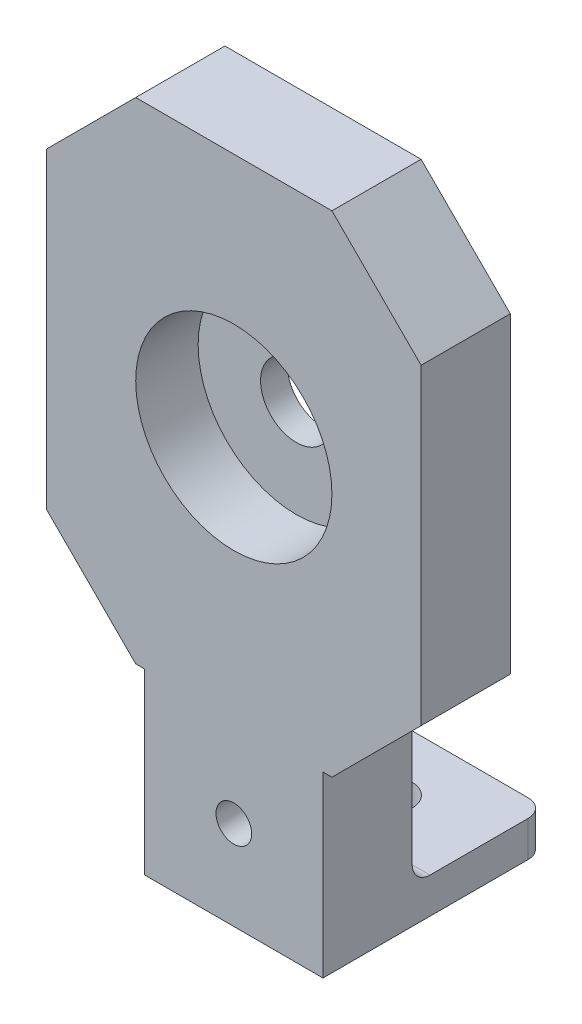
ISO-10303-21;
HEADER;
FILE_DESCRIPTION(('STEP AP214'),'2;1');
FILE_NAME('part.step','',(''),(''),'','','');
FILE_SCHEMA(('AUTOMOTIVE_DESIGN { 1 0 10303 214 1 1 1 1 }'));
ENDSEC;
DATA;
#1=APPLICATION_CONTEXT('core data for automotive mechanical design processes');
#2=APPLICATION_PROTOCOL_DEFINITION('international standard','automotive_design',2000,#1);
#3=PRODUCT_CONTEXT('',#1,'mechanical');
#4=PRODUCT('Part','Part','',(#3));
#5=PRODUCT_RELATED_PRODUCT_CATEGORY('part','',(#4));
#6=PRODUCT_DEFINITION_FORMATION('','',#4);
#7=PRODUCT_DEFINITION_CONTEXT('part definition',#1,'design');
#8=PRODUCT_DEFINITION('design','',#6,#7);
#9=PRODUCT_DEFINITION_SHAPE('','',#8);
#10=(LENGTH_UNIT() NAMED_UNIT(*) SI_UNIT(.MILLI.,.METRE.));
#11=(NAMED_UNIT(*) PLANE_ANGLE_UNIT() SI_UNIT($,.RADIAN.));
#12=(NAMED_UNIT(*) SI_UNIT($,.STERADIAN.) SOLID_ANGLE_UNIT());
#13=UNCERTAINTY_MEASURE_WITH_UNIT(LENGTH_MEASURE(1.E-05),#10,'distance_accuracy_value','');
#14=(GEOMETRIC_REPRESENTATION_CONTEXT(3) GLOBAL_UNCERTAINTY_ASSIGNED_CONTEXT((#13)) GLOBAL_UNIT_ASSIGNED_CONTEXT((#10,
#11,#12)) REPRESENTATION_CONTEXT('',''));
#15=CARTESIAN_POINT('',(0.,0.,0.));
#16=DIRECTION('',(0.,0.,1.));
#17=DIRECTION('',(1.,0.,0.));
#18=AXIS2_PLACEMENT_3D('',#15,#16,#17);
#19=CARTESIAN_POINT('',(21.,-27.5,10.));
#20=DIRECTION('',(-1.,0.,0.));
#21=DIRECTION('',(0.,-1.,0.));
#22=AXIS2_PLACEMENT_3D('',#19,#20,#21);
#23=PLANE('',#22);
#24=DIRECTION('',(0.,1.,0.));
#25=VECTOR('',#24,1.);
#26=CARTESIAN_POINT('',(21.,-27.5,10.));
#27=LINE('',#26,#25);
#28=CARTESIAN_POINT('',(21.,-17.5,10.));
#29=VERTEX_POINT('',#28);
#30=CARTESIAN_POINT('',(21.,17.5,10.));
#31=VERTEX_POINT('',#30);
#32=EDGE_CURVE('E211',#29,#31,#27,.T.);
#33=ORIENTED_EDGE('',*,*,#32,.F.);
#34=DIRECTION('',(0.,0.,-1.));
#35=VECTOR('',#34,1.);
#36=CARTESIAN_POINT('',(21.,-17.5,10.));
#37=LINE('',#36,#35);
#38=CARTESIAN_POINT('',(21.,-17.5,0.));
#39=VERTEX_POINT('',#38);
#40=EDGE_CURVE('E240',#29,#39,#37,.T.);
#41=ORIENTED_EDGE('',*,*,#40,.T.);
#42=DIRECTION('',(0.,1.,0.));
#43=VECTOR('',#42,1.);
#44=CARTESIAN_POINT('',(21.,-27.5,0.));
#45=LINE('',#44,#43);
#46=CARTESIAN_POINT('',(21.,17.5,0.));
#47=VERTEX_POINT('',#46);
#48=EDGE_CURVE('E193',#39,#47,#45,.T.);
#49=ORIENTED_EDGE('',*,*,#48,.T.);
#50=DIRECTION('',(0.,0.,1.));
#51=VECTOR('',#50,1.);
#52=CARTESIAN_POINT('',(21.,17.5,10.));
#53=LINE('',#52,#51);
#54=EDGE_CURVE('E238',#47,#31,#53,.T.);
#55=ORIENTED_EDGE('',*,*,#54,.T.);
#56=EDGE_LOOP('',(#33,#41,#49,#55));
#57=FACE_BOUND('',#56,.T.);
#58=ADVANCED_FACE('F37',(#57),#23,.F.);
#59=CARTESIAN_POINT('',(-21.,27.5,10.));
#60=DIRECTION('',(0.,-1.,0.));
#61=DIRECTION('',(1.,0.,0.));
#62=AXIS2_PLACEMENT_3D('',#59,#60,#61);
#63=PLANE('',#62);
#64=DIRECTION('',(-1.,0.,0.));
#65=VECTOR('',#64,1.);
#66=CARTESIAN_POINT('',(-21.,27.5,10.));
#67=LINE('',#66,#65);
#68=CARTESIAN_POINT('',(11.,27.5,10.));
#69=VERTEX_POINT('',#68);
#70=CARTESIAN_POINT('',(-11.,27.5,10.));
#71=VERTEX_POINT('',#70);
#72=EDGE_CURVE('E309',#69,#71,#67,.T.);
#73=ORIENTED_EDGE('',*,*,#72,.F.);
#74=DIRECTION('',(0.,0.,-1.));
#75=VECTOR('',#74,1.);
#76=CARTESIAN_POINT('',(11.,27.5,10.));
#77=LINE('',#76,#75);
#78=CARTESIAN_POINT('',(11.,27.5,0.));
#79=VERTEX_POINT('',#78);
#80=EDGE_CURVE('E247',#69,#79,#77,.T.);
#81=ORIENTED_EDGE('',*,*,#80,.T.);
#82=DIRECTION('',(-1.,0.,0.));
#83=VECTOR('',#82,1.);
#84=CARTESIAN_POINT('',(-21.,27.5,0.));
#85=LINE('',#84,#83);
#86=CARTESIAN_POINT('',(-11.,27.5,0.));
#87=VERTEX_POINT('',#86);
#88=EDGE_CURVE('E196',#79,#87,#85,.T.);
#89=ORIENTED_EDGE('',*,*,#88,.T.);
#90=DIRECTION('',(0.,0.,1.));
#91=VECTOR('',#90,1.);
#92=CARTESIAN_POINT('',(-11.,27.5,10.));
#93=LINE('',#92,#91);
#94=EDGE_CURVE('E245',#87,#71,#93,.T.);
#95=ORIENTED_EDGE('',*,*,#94,.T.);
#96=EDGE_LOOP('',(#73,#81,#89,#95));
#97=FACE_BOUND('',#96,.T.);
#98=ADVANCED_FACE('F326',(#97),#63,.F.);
#99=CARTESIAN_POINT('',(-21.,-27.5,10.));
#100=DIRECTION('',(1.,0.,0.));
#101=DIRECTION('',(0.,0.,-1.));
#102=AXIS2_PLACEMENT_3D('',#99,#100,#101);
#103=PLANE('',#102);
#104=DIRECTION('',(0.,-1.,0.));
#105=VECTOR('',#104,1.);
#106=CARTESIAN_POINT('',(-21.,-27.5,0.));
#107=LINE('',#106,#105);
#108=CARTESIAN_POINT('',(-21.,17.5,0.));
#109=VERTEX_POINT('',#108);
#110=CARTESIAN_POINT('',(-21.,-17.5,0.));
#111=VERTEX_POINT('',#110);
#112=EDGE_CURVE('E200',#109,#111,#107,.T.);
#113=ORIENTED_EDGE('',*,*,#112,.T.);
#114=DIRECTION('',(0.,0.,1.));
#115=VECTOR('',#114,1.);
#116=CARTESIAN_POINT('',(-21.,-17.5,10.));
#117=LINE('',#116,#115);
#118=CARTESIAN_POINT('',(-21.,-17.5,10.));
#119=VERTEX_POINT('',#118);
#120=EDGE_CURVE('E229',#111,#119,#117,.T.);
#121=ORIENTED_EDGE('',*,*,#120,.T.);
#122=DIRECTION('',(0.,-1.,0.));
#123=VECTOR('',#122,1.);
#124=CARTESIAN_POINT('',(-21.,-27.5,10.));
#125=LINE('',#124,#123);
#126=CARTESIAN_POINT('',(-21.,17.5,10.));
#127=VERTEX_POINT('',#126);
#128=EDGE_CURVE('E168',#127,#119,#125,.T.);
#129=ORIENTED_EDGE('',*,*,#128,.F.);
#130=DIRECTION('',(0.,0.,-1.));
#131=VECTOR('',#130,1.);
#132=CARTESIAN_POINT('',(-21.,17.5,10.));
#133=LINE('',#132,#131);
#134=EDGE_CURVE('E226',#127,#109,#133,.T.);
#135=ORIENTED_EDGE('',*,*,#134,.T.);
#136=EDGE_LOOP('',(#113,#121,#129,#135));
#137=FACE_BOUND('',#136,.T.);
#138=ADVANCED_FACE('F319',(#137),#103,.F.);
#139=CARTESIAN_POINT('',(-9.99999999999999,-27.5,10.));
#140=DIRECTION('',(0.,1.,0.));
#141=DIRECTION('',(0.,0.,1.));
#142=AXIS2_PLACEMENT_3D('',#139,#140,#141);
#143=PLANE('',#142);
#144=DIRECTION('',(1.,0.,0.));
#145=VECTOR('',#144,1.);
#146=CARTESIAN_POINT('',(-9.99999999999999,-27.5,10.));
#147=LINE('',#146,#145);
#148=CARTESIAN_POINT('',(-11.,-27.5,10.));
#149=VERTEX_POINT('',#148);
#150=CARTESIAN_POINT('',(-9.99999999999999,-27.5,10.));
#151=VERTEX_POINT('',#150);
#152=EDGE_CURVE('E157',#149,#151,#147,.T.);
#153=ORIENTED_EDGE('',*,*,#152,.F.);
#154=DIRECTION('',(0.,0.,-1.));
#155=VECTOR('',#154,1.);
#156=CARTESIAN_POINT('',(-11.,-27.5,10.));
#157=LINE('',#156,#155);
#158=CARTESIAN_POINT('',(-11.,-27.5,0.));
#159=VERTEX_POINT('',#158);
#160=EDGE_CURVE('E177',#149,#159,#157,.T.);
#161=ORIENTED_EDGE('',*,*,#160,.T.);
#162=DIRECTION('',(1.,0.,0.));
#163=VECTOR('',#162,1.);
#164=CARTESIAN_POINT('',(-9.99999999999999,-27.5,0.));
#165=LINE('',#164,#163);
#166=CARTESIAN_POINT('',(-9.99999999999999,-27.5,0.));
#167=VERTEX_POINT('',#166);
#168=EDGE_CURVE('E174',#159,#167,#165,.T.);
#169=ORIENTED_EDGE('',*,*,#168,.T.);
#170=DIRECTION('',(0.,0.,-1.));
#171=VECTOR('',#170,1.);
#172=CARTESIAN_POINT('',(-9.99999999999999,-27.5,10.));
#173=LINE('',#172,#171);
#174=EDGE_CURVE('E171',#151,#167,#173,.T.);
#175=ORIENTED_EDGE('',*,*,#174,.F.);
#176=EDGE_LOOP('',(#153,#161,#169,#175));
#177=FACE_BOUND('',#176,.T.);
#178=ADVANCED_FACE('F172',(#177),#143,.F.);
#179=CARTESIAN_POINT('',(-10.,-47.5,10.));
#180=DIRECTION('',(1.,0.,0.));
#181=DIRECTION('',(0.,1.,0.));
#182=AXIS2_PLACEMENT_3D('',#179,#180,#181);
#183=PLANE('',#182);
#184=DIRECTION('',(0.,0.,1.));
#185=VECTOR('',#184,1.);
#186=CARTESIAN_POINT('',(-9.99999999999999,-43.5,-15.));
#187=LINE('',#186,#185);
#188=CARTESIAN_POINT('',(-9.99999999999999,-43.5,-13.));
#189=VERTEX_POINT('',#188);
#190=CARTESIAN_POINT('',(-9.99999999999999,-43.5,-2.));
#191=VERTEX_POINT('',#190);
#192=EDGE_CURVE('E287',#189,#191,#187,.T.);
#193=ORIENTED_EDGE('',*,*,#192,.F.);
#194=DIRECTION('',(0.,1.,0.));
#195=VECTOR('',#194,1.);
#196=CARTESIAN_POINT('',(-10.,-47.5,-13.));
#197=LINE('',#196,#195);
#198=CARTESIAN_POINT('',(-10.,-47.5,-13.));
#199=VERTEX_POINT('',#198);
#200=EDGE_CURVE('E60',#189,#199,#197,.F.);
#201=ORIENTED_EDGE('',*,*,#200,.T.);
#202=DIRECTION('',(0.,0.,-1.));
#203=VECTOR('',#202,1.);
#204=CARTESIAN_POINT('',(-10.,-47.5,10.));
#205=LINE('',#204,#203);
#206=CARTESIAN_POINT('',(-10.,-47.5,10.));
#207=VERTEX_POINT('',#206);
#208=EDGE_CURVE('E178',#207,#199,#205,.T.);
#209=ORIENTED_EDGE('',*,*,#208,.F.);
#210=DIRECTION('',(0.,-1.,0.));
#211=VECTOR('',#210,1.);
#212=CARTESIAN_POINT('',(-10.,-47.5,10.));
#213=LINE('',#212,#211);
#214=EDGE_CURVE('E162',#151,#207,#213,.T.);
#215=ORIENTED_EDGE('',*,*,#214,.F.);
#216=ORIENTED_EDGE('',*,*,#174,.T.);
#217=DIRECTION('',(0.,-1.,0.));
#218=VECTOR('',#217,1.);
#219=CARTESIAN_POINT('',(-10.,-47.5,0.));
#220=LINE('',#219,#218);
#221=CARTESIAN_POINT('',(-10.,-41.5,0.));
#222=VERTEX_POINT('',#221);
#223=EDGE_CURVE('E204',#167,#222,#220,.T.);
#224=ORIENTED_EDGE('',*,*,#223,.T.);
#225=CARTESIAN_POINT('',(-10.,-41.5,-2.));
#226=DIRECTION('',(1.,0.,0.));
#227=DIRECTION('',(0.,1.,0.));
#228=AXIS2_PLACEMENT_3D('',#225,#226,#227);
#229=CIRCLE('',#228,2.);
#230=EDGE_CURVE('E11',#222,#191,#229,.T.);
#231=ORIENTED_EDGE('',*,*,#230,.T.);
#232=EDGE_LOOP('',(#193,#201,#209,#215,#216,#224,#231));
#233=FACE_BOUND('',#232,.T.);
#234=ADVANCED_FACE('F180',(#233),#183,.F.);
#235=CARTESIAN_POINT('',(-10.,-47.5,10.));
#236=DIRECTION('',(0.,1.,0.));
#237=DIRECTION('',(0.,0.,1.));
#238=AXIS2_PLACEMENT_3D('',#235,#236,#237);
#239=PLANE('',#238);
#240=CARTESIAN_POINT('',(0.,-47.5,-7.5));
#241=DIRECTION('',(0.,1.,0.));
#242=DIRECTION('',(0.,0.,1.));
#243=AXIS2_PLACEMENT_3D('',#240,#241,#242);
#244=CIRCLE('',#243,2.5);
#245=CARTESIAN_POINT('',(0.,-47.5,-5.));
#246=VERTEX_POINT('',#245);
#247=EDGE_CURVE('E403',#246,#246,#244,.T.);
#248=ORIENTED_EDGE('',*,*,#247,.T.);
#249=EDGE_LOOP('',(#248));
#250=FACE_BOUND('',#249,.T.);
#251=ORIENTED_EDGE('',*,*,#208,.T.);
#252=CARTESIAN_POINT('',(-8.,-47.5,-13.));
#253=DIRECTION('',(0.,1.,0.));
#254=DIRECTION('',(0.,0.,1.));
#255=AXIS2_PLACEMENT_3D('',#252,#253,#254);
#256=CIRCLE('',#255,2.);
#257=CARTESIAN_POINT('',(-7.99999999999999,-47.5,-15.));
#258=VERTEX_POINT('',#257);
#259=EDGE_CURVE('E267',#199,#258,#256,.F.);
#260=ORIENTED_EDGE('',*,*,#259,.T.);
#261=DIRECTION('',(-1.,0.,0.));
#262=VECTOR('',#261,1.);
#263=CARTESIAN_POINT('',(10.,-47.5,-15.));
#264=LINE('',#263,#262);
#265=CARTESIAN_POINT('',(8.00000000000001,-47.5,-15.));
#266=VERTEX_POINT('',#265);
#267=EDGE_CURVE('E398',#266,#258,#264,.T.);
#268=ORIENTED_EDGE('',*,*,#267,.F.);
#269=CARTESIAN_POINT('',(8.00000000000001,-47.5,-13.));
#270=DIRECTION('',(0.,1.,0.));
#271=DIRECTION('',(0.,0.,1.));
#272=AXIS2_PLACEMENT_3D('',#269,#270,#271);
#273=CIRCLE('',#272,2.);
#274=CARTESIAN_POINT('',(10.,-47.5,-13.));
#275=VERTEX_POINT('',#274);
#276=EDGE_CURVE('E52',#266,#275,#273,.F.);
#277=ORIENTED_EDGE('',*,*,#276,.T.);
#278=DIRECTION('',(0.,0.,-1.));
#279=VECTOR('',#278,1.);
#280=CARTESIAN_POINT('',(10.,-47.5,10.));
#281=LINE('',#280,#279);
#282=CARTESIAN_POINT('',(10.,-47.5,10.));
#283=VERTEX_POINT('',#282);
#284=EDGE_CURVE('E214',#283,#275,#281,.T.);
#285=ORIENTED_EDGE('',*,*,#284,.F.);
#286=DIRECTION('',(1.,0.,0.));
#287=VECTOR('',#286,1.);
#288=CARTESIAN_POINT('',(-10.,-47.5,10.));
#289=LINE('',#288,#287);
#290=EDGE_CURVE('E182',#207,#283,#289,.T.);
#291=ORIENTED_EDGE('',*,*,#290,.F.);
#292=EDGE_LOOP('',(#251,#260,#268,#277,#285,#291));
#293=FACE_BOUND('',#292,.T.);
#294=ADVANCED_FACE('F345',(#250,#293),#239,.F.);
#295=CARTESIAN_POINT('',(10.,-47.5,10.));
#296=DIRECTION('',(-1.,0.,0.));
#297=DIRECTION('',(0.,-1.,0.));
#298=AXIS2_PLACEMENT_3D('',#295,#296,#297);
#299=PLANE('',#298);
#300=ORIENTED_EDGE('',*,*,#284,.T.);
#301=DIRECTION('',(0.,-1.,0.));
#302=VECTOR('',#301,1.);
#303=CARTESIAN_POINT('',(10.,-47.5,-13.));
#304=LINE('',#303,#302);
#305=CARTESIAN_POINT('',(10.,-43.5,-13.));
#306=VERTEX_POINT('',#305);
#307=EDGE_CURVE('E269',#275,#306,#304,.F.);
#308=ORIENTED_EDGE('',*,*,#307,.T.);
#309=DIRECTION('',(0.,0.,1.));
#310=VECTOR('',#309,1.);
#311=CARTESIAN_POINT('',(10.,-43.5,-15.));
#312=LINE('',#311,#310);
#313=CARTESIAN_POINT('',(10.,-43.5,-2.));
#314=VERTEX_POINT('',#313);
#315=EDGE_CURVE('E276',#306,#314,#312,.T.);
#316=ORIENTED_EDGE('',*,*,#315,.T.);
#317=CARTESIAN_POINT('',(10.,-41.5,-2.));
#318=DIRECTION('',(-1.,0.,0.));
#319=DIRECTION('',(0.,-1.,0.));
#320=AXIS2_PLACEMENT_3D('',#317,#318,#319);
#321=CIRCLE('',#320,2.);
#322=CARTESIAN_POINT('',(10.,-41.5,0.));
#323=VERTEX_POINT('',#322);
#324=EDGE_CURVE('E45',#314,#323,#321,.T.);
#325=ORIENTED_EDGE('',*,*,#324,.T.);
#326=DIRECTION('',(0.,1.,0.));
#327=VECTOR('',#326,1.);
#328=CARTESIAN_POINT('',(10.,-47.5,0.));
#329=LINE('',#328,#327);
#330=CARTESIAN_POINT('',(10.,-27.5,0.));
#331=VERTEX_POINT('',#330);
#332=EDGE_CURVE('E206',#323,#331,#329,.T.);
#333=ORIENTED_EDGE('',*,*,#332,.T.);
#334=DIRECTION('',(0.,0.,-1.));
#335=VECTOR('',#334,1.);
#336=CARTESIAN_POINT('',(10.,-27.5,10.));
#337=LINE('',#336,#335);
#338=CARTESIAN_POINT('',(10.,-27.5,10.));
#339=VERTEX_POINT('',#338);
#340=EDGE_CURVE('E192',#339,#331,#337,.T.);
#341=ORIENTED_EDGE('',*,*,#340,.F.);
#342=DIRECTION('',(0.,1.,0.));
#343=VECTOR('',#342,1.);
#344=CARTESIAN_POINT('',(10.,-47.5,10.));
#345=LINE('',#344,#343);
#346=EDGE_CURVE('E184',#283,#339,#345,.T.);
#347=ORIENTED_EDGE('',*,*,#346,.F.);
#348=EDGE_LOOP('',(#300,#308,#316,#325,#333,#341,#347));
#349=FACE_BOUND('',#348,.T.);
#350=ADVANCED_FACE('F273',(#349),#299,.F.);
#351=CARTESIAN_POINT('',(10.,-27.5,10.));
#352=DIRECTION('',(0.,1.,0.));
#353=DIRECTION('',(0.,0.,1.));
#354=AXIS2_PLACEMENT_3D('',#351,#352,#353);
#355=PLANE('',#354);
#356=DIRECTION('',(1.,0.,0.));
#357=VECTOR('',#356,1.);
#358=CARTESIAN_POINT('',(10.,-27.5,0.));
#359=LINE('',#358,#357);
#360=CARTESIAN_POINT('',(11.,-27.5,0.));
#361=VERTEX_POINT('',#360);
#362=EDGE_CURVE('E208',#331,#361,#359,.T.);
#363=ORIENTED_EDGE('',*,*,#362,.T.);
#364=DIRECTION('',(0.,0.,1.));
#365=VECTOR('',#364,1.);
#366=CARTESIAN_POINT('',(11.,-27.5,10.));
#367=LINE('',#366,#365);
#368=CARTESIAN_POINT('',(11.,-27.5,10.));
#369=VERTEX_POINT('',#368);
#370=EDGE_CURVE('E243',#361,#369,#367,.T.);
#371=ORIENTED_EDGE('',*,*,#370,.T.);
#372=DIRECTION('',(1.,0.,0.));
#373=VECTOR('',#372,1.);
#374=CARTESIAN_POINT('',(10.,-27.5,10.));
#375=LINE('',#374,#373);
#376=EDGE_CURVE('E189',#339,#369,#375,.T.);
#377=ORIENTED_EDGE('',*,*,#376,.F.);
#378=ORIENTED_EDGE('',*,*,#340,.T.);
#379=EDGE_LOOP('',(#363,#371,#377,#378));
#380=FACE_BOUND('',#379,.T.);
#381=ADVANCED_FACE('F341',(#380),#355,.F.);
#382=CARTESIAN_POINT('',(0.,0.,10.));
#383=DIRECTION('',(0.,0.,-1.));
#384=DIRECTION('',(-1.,0.,0.));
#385=AXIS2_PLACEMENT_3D('',#382,#383,#384);
#386=PLANE('',#385);
#387=CARTESIAN_POINT('',(0.,-37.5,10.));
#388=DIRECTION('',(0.,0.,-1.));
#389=DIRECTION('',(-1.,0.,0.));
#390=AXIS2_PLACEMENT_3D('',#387,#388,#389);
#391=CIRCLE('',#390,2.);
#392=CARTESIAN_POINT('',(-2.,-37.5,10.));
#393=VERTEX_POINT('',#392);
#394=EDGE_CURVE('E410',#393,#393,#391,.T.);
#395=ORIENTED_EDGE('',*,*,#394,.T.);
#396=EDGE_LOOP('',(#395));
#397=FACE_BOUND('',#396,.T.);
#398=CARTESIAN_POINT('',(0.,0.,10.));
#399=DIRECTION('',(0.,0.,1.));
#400=DIRECTION('',(1.,0.,0.));
#401=AXIS2_PLACEMENT_3D('',#398,#399,#400);
#402=CIRCLE('',#401,11.);
#403=CARTESIAN_POINT('',(11.,0.,10.));
#404=VERTEX_POINT('',#403);
#405=EDGE_CURVE('E301',#404,#404,#402,.T.);
#406=ORIENTED_EDGE('',*,*,#405,.F.);
#407=EDGE_LOOP('',(#406));
#408=FACE_BOUND('',#407,.T.);
#409=ORIENTED_EDGE('',*,*,#128,.T.);
#410=DIRECTION('',(-0.707106781186546,0.707106781186549,0.));
#411=VECTOR('',#410,1.);
#412=CARTESIAN_POINT('',(-11.,-27.5,10.));
#413=LINE('',#412,#411);
#414=EDGE_CURVE('E164',#119,#149,#413,.F.);
#415=ORIENTED_EDGE('',*,*,#414,.T.);
#416=ORIENTED_EDGE('',*,*,#152,.T.);
#417=ORIENTED_EDGE('',*,*,#214,.T.);
#418=ORIENTED_EDGE('',*,*,#290,.T.);
#419=ORIENTED_EDGE('',*,*,#346,.T.);
#420=ORIENTED_EDGE('',*,*,#376,.T.);
#421=DIRECTION('',(-0.707106781186548,-0.707106781186547,0.));
#422=VECTOR('',#421,1.);
#423=CARTESIAN_POINT('',(21.,-17.5,10.));
#424=LINE('',#423,#422);
#425=EDGE_CURVE('E235',#369,#29,#424,.F.);
#426=ORIENTED_EDGE('',*,*,#425,.T.);
#427=ORIENTED_EDGE('',*,*,#32,.T.);
#428=DIRECTION('',(0.707106781186547,-0.707106781186548,0.));
#429=VECTOR('',#428,1.);
#430=CARTESIAN_POINT('',(11.,27.5,10.));
#431=LINE('',#430,#429);
#432=EDGE_CURVE('E233',#31,#69,#431,.F.);
#433=ORIENTED_EDGE('',*,*,#432,.T.);
#434=ORIENTED_EDGE('',*,*,#72,.T.);
#435=DIRECTION('',(0.707106781186549,0.707106781186546,0.));
#436=VECTOR('',#435,1.);
#437=CARTESIAN_POINT('',(-21.,17.5,10.));
#438=LINE('',#437,#436);
#439=EDGE_CURVE('E231',#71,#127,#438,.F.);
#440=ORIENTED_EDGE('',*,*,#439,.T.);
#441=EDGE_LOOP('',(#409,#415,#416,#417,#418,#419,#420,#426,#427,#433,#434,#440));
#442=FACE_BOUND('',#441,.T.);
#443=ADVANCED_FACE('F160',(#397,#408,#442),#386,.F.);
#444=CARTESIAN_POINT('',(0.,0.,0.));
#445=DIRECTION('',(0.,0.,-1.));
#446=DIRECTION('',(-1.,0.,0.));
#447=AXIS2_PLACEMENT_3D('',#444,#445,#446);
#448=PLANE('',#447);
#449=CARTESIAN_POINT('',(0.,-37.5,0.));
#450=DIRECTION('',(0.,0.,-1.));
#451=DIRECTION('',(-1.,0.,0.));
#452=AXIS2_PLACEMENT_3D('',#449,#450,#451);
#453=CIRCLE('',#452,2.);
#454=CARTESIAN_POINT('',(-2.,-37.5,0.));
#455=VERTEX_POINT('',#454);
#456=EDGE_CURVE('E411',#455,#455,#453,.T.);
#457=ORIENTED_EDGE('',*,*,#456,.F.);
#458=EDGE_LOOP('',(#457));
#459=FACE_BOUND('',#458,.T.);
#460=ORIENTED_EDGE('',*,*,#332,.F.);
#461=DIRECTION('',(1.,0.,0.));
#462=VECTOR('',#461,1.);
#463=CARTESIAN_POINT('',(0.,-41.5,0.));
#464=LINE('',#463,#462);
#465=EDGE_CURVE('E257',#323,#222,#464,.F.);
#466=ORIENTED_EDGE('',*,*,#465,.T.);
#467=ORIENTED_EDGE('',*,*,#223,.F.);
#468=ORIENTED_EDGE('',*,*,#168,.F.);
#469=DIRECTION('',(0.707106781186546,-0.707106781186549,0.));
#470=VECTOR('',#469,1.);
#471=CARTESIAN_POINT('',(-19.25,-19.25,0.));
#472=LINE('',#471,#470);
#473=EDGE_CURVE('E224',#159,#111,#472,.F.);
#474=ORIENTED_EDGE('',*,*,#473,.T.);
#475=ORIENTED_EDGE('',*,*,#112,.F.);
#476=DIRECTION('',(-0.707106781186549,-0.707106781186546,0.));
#477=VECTOR('',#476,1.);
#478=CARTESIAN_POINT('',(-19.25,19.25,0.));
#479=LINE('',#478,#477);
#480=EDGE_CURVE('E218',#109,#87,#479,.F.);
#481=ORIENTED_EDGE('',*,*,#480,.T.);
#482=ORIENTED_EDGE('',*,*,#88,.F.);
#483=DIRECTION('',(-0.707106781186547,0.707106781186548,0.));
#484=VECTOR('',#483,1.);
#485=CARTESIAN_POINT('',(19.25,19.25,0.));
#486=LINE('',#485,#484);
#487=EDGE_CURVE('E220',#79,#47,#486,.F.);
#488=ORIENTED_EDGE('',*,*,#487,.T.);
#489=ORIENTED_EDGE('',*,*,#48,.F.);
#490=DIRECTION('',(0.707106781186548,0.707106781186547,0.));
#491=VECTOR('',#490,1.);
#492=CARTESIAN_POINT('',(19.25,-19.25,0.));
#493=LINE('',#492,#491);
#494=EDGE_CURVE('E222',#39,#361,#493,.F.);
#495=ORIENTED_EDGE('',*,*,#494,.T.);
#496=ORIENTED_EDGE('',*,*,#362,.F.);
#497=EDGE_LOOP('',(#460,#466,#467,#468,#474,#475,#481,#482,#488,#489,#495,#496));
#498=FACE_BOUND('',#497,.T.);
#499=CARTESIAN_POINT('',(0.,0.,0.));
#500=DIRECTION('',(0.,0.,1.));
#501=DIRECTION('',(1.,0.,0.));
#502=AXIS2_PLACEMENT_3D('',#499,#500,#501);
#503=CIRCLE('',#502,4.);
#504=CARTESIAN_POINT('',(4.,0.,0.));
#505=VERTEX_POINT('',#504);
#506=EDGE_CURVE('E294',#505,#505,#503,.T.);
#507=ORIENTED_EDGE('',*,*,#506,.T.);
#508=EDGE_LOOP('',(#507));
#509=FACE_BOUND('',#508,.T.);
#510=ADVANCED_FACE('F282',(#459,#498,#509),#448,.T.);
#511=CARTESIAN_POINT('',(0.,0.,3.));
#512=DIRECTION('',(0.,0.,1.));
#513=DIRECTION('',(1.,0.,0.));
#514=AXIS2_PLACEMENT_3D('',#511,#512,#513);
#515=CYLINDRICAL_SURFACE('',#514,11.);
#516=CARTESIAN_POINT('',(0.,0.,3.));
#517=DIRECTION('',(0.,0.,1.));
#518=DIRECTION('',(1.,0.,0.));
#519=AXIS2_PLACEMENT_3D('',#516,#517,#518);
#520=CIRCLE('',#519,11.);
#521=CARTESIAN_POINT('',(11.,0.,3.));
#522=VERTEX_POINT('',#521);
#523=EDGE_CURVE('E197',#522,#522,#520,.T.);
#524=ORIENTED_EDGE('',*,*,#523,.F.);
#525=EDGE_LOOP('',(#524));
#526=FACE_BOUND('',#525,.T.);
#527=ORIENTED_EDGE('',*,*,#405,.T.);
#528=EDGE_LOOP('',(#527));
#529=FACE_BOUND('',#528,.T.);
#530=ADVANCED_FACE('F425',(#526,#529),#515,.F.);
#531=CARTESIAN_POINT('',(0.,0.,3.));
#532=DIRECTION('',(0.,0.,1.));
#533=DIRECTION('',(1.,0.,0.));
#534=AXIS2_PLACEMENT_3D('',#531,#532,#533);
#535=PLANE('',#534);
#536=CARTESIAN_POINT('',(0.,0.,3.));
#537=DIRECTION('',(0.,0.,1.));
#538=DIRECTION('',(1.,0.,0.));
#539=AXIS2_PLACEMENT_3D('',#536,#537,#538);
#540=CIRCLE('',#539,4.);
#541=CARTESIAN_POINT('',(4.,0.,3.));
#542=VERTEX_POINT('',#541);
#543=EDGE_CURVE('E291',#542,#542,#540,.T.);
#544=ORIENTED_EDGE('',*,*,#543,.F.);
#545=EDGE_LOOP('',(#544));
#546=FACE_BOUND('',#545,.T.);
#547=ORIENTED_EDGE('',*,*,#523,.T.);
#548=EDGE_LOOP('',(#547));
#549=FACE_BOUND('',#548,.T.);
#550=ADVANCED_FACE('F431',(#546,#549),#535,.T.);
#551=CARTESIAN_POINT('',(0.,0.,0.));
#552=DIRECTION('',(0.,0.,1.));
#553=DIRECTION('',(1.,0.,0.));
#554=AXIS2_PLACEMENT_3D('',#551,#552,#553);
#555=CYLINDRICAL_SURFACE('',#554,4.);
#556=ORIENTED_EDGE('',*,*,#506,.F.);
#557=EDGE_LOOP('',(#556));
#558=FACE_BOUND('',#557,.T.);
#559=ORIENTED_EDGE('',*,*,#543,.T.);
#560=EDGE_LOOP('',(#559));
#561=FACE_BOUND('',#560,.T.);
#562=ADVANCED_FACE('F371',(#558,#561),#555,.F.);
#563=CARTESIAN_POINT('',(-11.,-27.5,10.));
#564=DIRECTION('',(0.707106781186549,0.707106781186546,0.));
#565=DIRECTION('',(0.,0.,-1.));
#566=AXIS2_PLACEMENT_3D('',#563,#564,#565);
#567=PLANE('',#566);
#568=ORIENTED_EDGE('',*,*,#414,.F.);
#569=ORIENTED_EDGE('',*,*,#120,.F.);
#570=ORIENTED_EDGE('',*,*,#473,.F.);
#571=ORIENTED_EDGE('',*,*,#160,.F.);
#572=EDGE_LOOP('',(#568,#569,#570,#571));
#573=FACE_BOUND('',#572,.T.);
#574=ADVANCED_FACE('F317',(#573),#567,.F.);
#575=CARTESIAN_POINT('',(21.,-17.5,10.));
#576=DIRECTION('',(-0.707106781186547,0.707106781186548,0.));
#577=DIRECTION('',(0.,0.,-1.));
#578=AXIS2_PLACEMENT_3D('',#575,#576,#577);
#579=PLANE('',#578);
#580=ORIENTED_EDGE('',*,*,#425,.F.);
#581=ORIENTED_EDGE('',*,*,#370,.F.);
#582=ORIENTED_EDGE('',*,*,#494,.F.);
#583=ORIENTED_EDGE('',*,*,#40,.F.);
#584=EDGE_LOOP('',(#580,#581,#582,#583));
#585=FACE_BOUND('',#584,.T.);
#586=ADVANCED_FACE('F338',(#585),#579,.F.);
#587=CARTESIAN_POINT('',(11.,27.5,10.));
#588=DIRECTION('',(-0.707106781186548,-0.707106781186547,0.));
#589=DIRECTION('',(0.,0.,-1.));
#590=AXIS2_PLACEMENT_3D('',#587,#588,#589);
#591=PLANE('',#590);
#592=ORIENTED_EDGE('',*,*,#432,.F.);
#593=ORIENTED_EDGE('',*,*,#54,.F.);
#594=ORIENTED_EDGE('',*,*,#487,.F.);
#595=ORIENTED_EDGE('',*,*,#80,.F.);
#596=EDGE_LOOP('',(#592,#593,#594,#595));
#597=FACE_BOUND('',#596,.T.);
#598=ADVANCED_FACE('F330',(#597),#591,.F.);
#599=CARTESIAN_POINT('',(-21.,17.5,10.));
#600=DIRECTION('',(0.707106781186546,-0.707106781186549,0.));
#601=DIRECTION('',(0.,0.,-1.));
#602=AXIS2_PLACEMENT_3D('',#599,#600,#601);
#603=PLANE('',#602);
#604=ORIENTED_EDGE('',*,*,#439,.F.);
#605=ORIENTED_EDGE('',*,*,#94,.F.);
#606=ORIENTED_EDGE('',*,*,#480,.F.);
#607=ORIENTED_EDGE('',*,*,#134,.F.);
#608=EDGE_LOOP('',(#604,#605,#606,#607));
#609=FACE_BOUND('',#608,.T.);
#610=ADVANCED_FACE('F321',(#609),#603,.F.);
#611=CARTESIAN_POINT('',(10.,-43.5,-15.));
#612=DIRECTION('',(0.,-1.,0.));
#613=DIRECTION('',(0.,0.,-1.));
#614=AXIS2_PLACEMENT_3D('',#611,#612,#613);
#615=PLANE('',#614);
#616=CARTESIAN_POINT('',(0.,-43.5,-7.5));
#617=DIRECTION('',(0.,1.,0.));
#618=DIRECTION('',(0.,0.,1.));
#619=AXIS2_PLACEMENT_3D('',#616,#617,#618);
#620=CIRCLE('',#619,2.5);
#621=CARTESIAN_POINT('',(0.,-43.5,-5.));
#622=VERTEX_POINT('',#621);
#623=EDGE_CURVE('E405',#622,#622,#620,.T.);
#624=ORIENTED_EDGE('',*,*,#623,.F.);
#625=EDGE_LOOP('',(#624));
#626=FACE_BOUND('',#625,.T.);
#627=ORIENTED_EDGE('',*,*,#192,.T.);
#628=DIRECTION('',(1.,0.,0.));
#629=VECTOR('',#628,1.);
#630=CARTESIAN_POINT('',(10.,-43.5,-2.));
#631=LINE('',#630,#629);
#632=EDGE_CURVE('E254',#191,#314,#631,.T.);
#633=ORIENTED_EDGE('',*,*,#632,.T.);
#634=ORIENTED_EDGE('',*,*,#315,.F.);
#635=CARTESIAN_POINT('',(8.00000000000001,-43.5,-13.));
#636=DIRECTION('',(0.,-1.,0.));
#637=DIRECTION('',(0.,0.,-1.));
#638=AXIS2_PLACEMENT_3D('',#635,#636,#637);
#639=CIRCLE('',#638,2.);
#640=CARTESIAN_POINT('',(8.00000000000001,-43.5,-15.));
#641=VERTEX_POINT('',#640);
#642=EDGE_CURVE('E250',#306,#641,#639,.F.);
#643=ORIENTED_EDGE('',*,*,#642,.T.);
#644=DIRECTION('',(1.,0.,0.));
#645=VECTOR('',#644,1.);
#646=CARTESIAN_POINT('',(10.,-43.5,-15.));
#647=LINE('',#646,#645);
#648=CARTESIAN_POINT('',(-7.99999999999999,-43.5,-15.));
#649=VERTEX_POINT('',#648);
#650=EDGE_CURVE('E296',#649,#641,#647,.T.);
#651=ORIENTED_EDGE('',*,*,#650,.F.);
#652=CARTESIAN_POINT('',(-8.,-43.5,-13.));
#653=DIRECTION('',(0.,-1.,0.));
#654=DIRECTION('',(0.,0.,-1.));
#655=AXIS2_PLACEMENT_3D('',#652,#653,#654);
#656=CIRCLE('',#655,2.);
#657=EDGE_CURVE('E252',#649,#189,#656,.F.);
#658=ORIENTED_EDGE('',*,*,#657,.T.);
#659=EDGE_LOOP('',(#627,#633,#634,#643,#651,#658));
#660=FACE_BOUND('',#659,.T.);
#661=ADVANCED_FACE('F289',(#626,#660),#615,.F.);
#662=CARTESIAN_POINT('',(0.,0.,-15.));
#663=DIRECTION('',(0.,0.,1.));
#664=DIRECTION('',(1.,0.,0.));
#665=AXIS2_PLACEMENT_3D('',#662,#663,#664);
#666=PLANE('',#665);
#667=ORIENTED_EDGE('',*,*,#267,.T.);
#668=DIRECTION('',(0.,1.,0.));
#669=VECTOR('',#668,1.);
#670=CARTESIAN_POINT('',(-7.99999999999999,0.,-15.));
#671=LINE('',#670,#669);
#672=EDGE_CURVE('E262',#258,#649,#671,.T.);
#673=ORIENTED_EDGE('',*,*,#672,.T.);
#674=ORIENTED_EDGE('',*,*,#650,.T.);
#675=DIRECTION('',(0.,-1.,0.));
#676=VECTOR('',#675,1.);
#677=CARTESIAN_POINT('',(7.99999999999999,0.,-15.));
#678=LINE('',#677,#676);
#679=EDGE_CURVE('E259',#641,#266,#678,.T.);
#680=ORIENTED_EDGE('',*,*,#679,.T.);
#681=EDGE_LOOP('',(#667,#673,#674,#680));
#682=FACE_BOUND('',#681,.T.);
#683=ADVANCED_FACE('F400',(#682),#666,.F.);
#684=CARTESIAN_POINT('',(0.,-78.5,-7.5));
#685=DIRECTION('',(0.,1.,0.));
#686=DIRECTION('',(0.,0.,1.));
#687=AXIS2_PLACEMENT_3D('',#684,#685,#686);
#688=CYLINDRICAL_SURFACE('',#687,2.5);
#689=ORIENTED_EDGE('',*,*,#623,.T.);
#690=EDGE_LOOP('',(#689));
#691=FACE_BOUND('',#690,.T.);
#692=ORIENTED_EDGE('',*,*,#247,.F.);
#693=EDGE_LOOP('',(#692));
#694=FACE_BOUND('',#693,.T.);
#695=ADVANCED_FACE('F388',(#691,#694),#688,.F.);
#696=CARTESIAN_POINT('',(10.,-41.5,-2.));
#697=DIRECTION('',(1.,0.,0.));
#698=DIRECTION('',(0.,0.,-1.));
#699=AXIS2_PLACEMENT_3D('',#696,#697,#698);
#700=CYLINDRICAL_SURFACE('',#699,2.);
#701=ORIENTED_EDGE('',*,*,#230,.F.);
#702=ORIENTED_EDGE('',*,*,#465,.F.);
#703=ORIENTED_EDGE('',*,*,#324,.F.);
#704=ORIENTED_EDGE('',*,*,#632,.F.);
#705=EDGE_LOOP('',(#701,#702,#703,#704));
#706=FACE_BOUND('',#705,.T.);
#707=ADVANCED_FACE('F285',(#706),#700,.F.);
#708=CARTESIAN_POINT('',(-7.99999999999999,0.,-13.));
#709=DIRECTION('',(0.,1.,0.));
#710=DIRECTION('',(-1.,0.,0.));
#711=AXIS2_PLACEMENT_3D('',#708,#709,#710);
#712=CYLINDRICAL_SURFACE('',#711,2.);
#713=ORIENTED_EDGE('',*,*,#259,.F.);
#714=ORIENTED_EDGE('',*,*,#200,.F.);
#715=ORIENTED_EDGE('',*,*,#657,.F.);
#716=ORIENTED_EDGE('',*,*,#672,.F.);
#717=EDGE_LOOP('',(#713,#714,#715,#716));
#718=FACE_BOUND('',#717,.T.);
#719=ADVANCED_FACE('F387',(#718),#712,.T.);
#720=CARTESIAN_POINT('',(7.99999999999999,0.,-13.));
#721=DIRECTION('',(0.,-1.,0.));
#722=DIRECTION('',(1.,0.,0.));
#723=AXIS2_PLACEMENT_3D('',#720,#721,#722);
#724=CYLINDRICAL_SURFACE('',#723,2.);
#725=ORIENTED_EDGE('',*,*,#642,.F.);
#726=ORIENTED_EDGE('',*,*,#307,.F.);
#727=ORIENTED_EDGE('',*,*,#276,.F.);
#728=ORIENTED_EDGE('',*,*,#679,.F.);
#729=EDGE_LOOP('',(#725,#726,#727,#728));
#730=FACE_BOUND('',#729,.T.);
#731=ADVANCED_FACE('F39',(#730),#724,.T.);
#732=CARTESIAN_POINT('',(0.,-37.5,10.));
#733=DIRECTION('',(0.,0.,-1.));
#734=DIRECTION('',(-1.,0.,0.));
#735=AXIS2_PLACEMENT_3D('',#732,#733,#734);
#736=CYLINDRICAL_SURFACE('',#735,2.);
#737=ORIENTED_EDGE('',*,*,#394,.F.);
#738=EDGE_LOOP('',(#737));
#739=FACE_BOUND('',#738,.T.);
#740=ORIENTED_EDGE('',*,*,#456,.T.);
#741=EDGE_LOOP('',(#740));
#742=FACE_BOUND('',#741,.T.);
#743=ADVANCED_FACE('F394',(#739,#742),#736,.F.);
#744=CLOSED_SHELL('',(#58,#98,#138,#178,#234,#294,#350,#381,#443,#510,#530,#550,#562,#574,#586,
#598,#610,#661,#683,#695,#707,#719,#731,#743));
#745=MANIFOLD_SOLID_BREP('B2',#744);
#746=ADVANCED_BREP_SHAPE_REPRESENTATION('',(#18,#745),#14);
#747=SHAPE_DEFINITION_REPRESENTATION(#9,#746);
ENDSEC;
END-ISO-10303-21;
